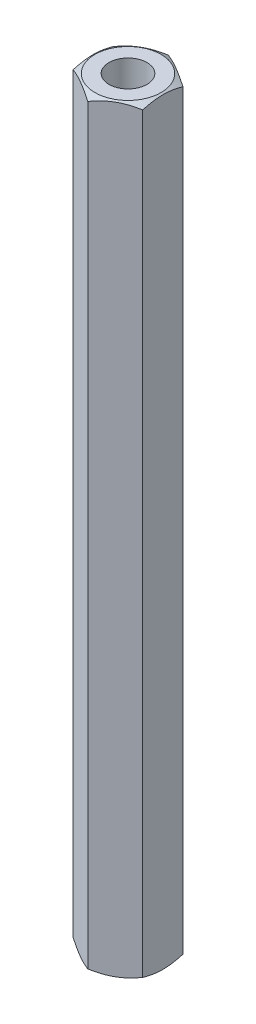
ISO-10303-21;
HEADER;
FILE_DESCRIPTION(('STEP AP214'),'2;1');
FILE_NAME('part.step','',(''),(''),'','','');
FILE_SCHEMA(('AUTOMOTIVE_DESIGN { 1 0 10303 214 1 1 1 1 }'));
ENDSEC;
DATA;
#1=APPLICATION_CONTEXT('core data for automotive mechanical design processes');
#2=APPLICATION_PROTOCOL_DEFINITION('international standard','automotive_design',2000,#1);
#3=PRODUCT_CONTEXT('',#1,'mechanical');
#4=PRODUCT('Part','Part','',(#3));
#5=PRODUCT_RELATED_PRODUCT_CATEGORY('part','',(#4));
#6=PRODUCT_DEFINITION_FORMATION('','',#4);
#7=PRODUCT_DEFINITION_CONTEXT('part definition',#1,'design');
#8=PRODUCT_DEFINITION('design','',#6,#7);
#9=PRODUCT_DEFINITION_SHAPE('','',#8);
#10=(LENGTH_UNIT() NAMED_UNIT(*) SI_UNIT(.MILLI.,.METRE.));
#11=(NAMED_UNIT(*) PLANE_ANGLE_UNIT() SI_UNIT($,.RADIAN.));
#12=(NAMED_UNIT(*) SI_UNIT($,.STERADIAN.) SOLID_ANGLE_UNIT());
#13=UNCERTAINTY_MEASURE_WITH_UNIT(LENGTH_MEASURE(1.E-05),#10,'distance_accuracy_value','');
#14=(GEOMETRIC_REPRESENTATION_CONTEXT(3) GLOBAL_UNCERTAINTY_ASSIGNED_CONTEXT((#13)) GLOBAL_UNIT_ASSIGNED_CONTEXT((#10,
#11,#12)) REPRESENTATION_CONTEXT('',''));
#15=CARTESIAN_POINT('',(0.,0.,0.));
#16=DIRECTION('',(0.,0.,1.));
#17=DIRECTION('',(1.,0.,0.));
#18=AXIS2_PLACEMENT_3D('',#15,#16,#17);
#19=CARTESIAN_POINT('',(0.,60.,0.));
#20=DIRECTION('',(0.,1.,0.));
#21=DIRECTION('',(0.,0.,1.));
#22=AXIS2_PLACEMENT_3D('',#19,#20,#21);
#23=PLANE('',#22);
#24=CARTESIAN_POINT('',(0.,60.,0.));
#25=DIRECTION('',(0.,1.,0.));
#26=DIRECTION('',(0.,0.,1.));
#27=AXIS2_PLACEMENT_3D('',#24,#25,#26);
#28=CIRCLE('',#27,1.5);
#29=CARTESIAN_POINT('',(0.,60.,1.5));
#30=VERTEX_POINT('',#29);
#31=EDGE_CURVE('E109',#30,#30,#28,.T.);
#32=ORIENTED_EDGE('',*,*,#31,.F.);
#33=EDGE_LOOP('',(#32));
#34=FACE_BOUND('',#33,.T.);
#35=CARTESIAN_POINT('',(0.,60.,0.));
#36=DIRECTION('',(0.,1.,0.));
#37=DIRECTION('',(0.,0.,1.));
#38=AXIS2_PLACEMENT_3D('',#35,#36,#37);
#39=CIRCLE('',#38,2.6125);
#40=CARTESIAN_POINT('',(0.,60.,2.6125));
#41=VERTEX_POINT('',#40);
#42=EDGE_CURVE('E214',#41,#41,#39,.T.);
#43=ORIENTED_EDGE('',*,*,#42,.T.);
#44=EDGE_LOOP('',(#43));
#45=FACE_BOUND('',#44,.T.);
#46=ADVANCED_FACE('F35',(#34,#45),#23,.T.);
#47=CARTESIAN_POINT('',(0.,0.,0.));
#48=DIRECTION('',(0.,1.,0.));
#49=DIRECTION('',(0.,0.,1.));
#50=AXIS2_PLACEMENT_3D('',#47,#48,#49);
#51=PLANE('',#50);
#52=CARTESIAN_POINT('',(0.,0.,0.));
#53=DIRECTION('',(0.,1.,0.));
#54=DIRECTION('',(0.,0.,1.));
#55=AXIS2_PLACEMENT_3D('',#52,#53,#54);
#56=CIRCLE('',#55,1.5);
#57=CARTESIAN_POINT('',(0.,0.,1.5));
#58=VERTEX_POINT('',#57);
#59=EDGE_CURVE('E114',#58,#58,#56,.T.);
#60=ORIENTED_EDGE('',*,*,#59,.T.);
#61=EDGE_LOOP('',(#60));
#62=FACE_BOUND('',#61,.T.);
#63=CARTESIAN_POINT('',(0.,0.,0.));
#64=DIRECTION('',(0.,1.,0.));
#65=DIRECTION('',(0.,0.,1.));
#66=AXIS2_PLACEMENT_3D('',#63,#64,#65);
#67=CIRCLE('',#66,2.6125);
#68=CARTESIAN_POINT('',(0.,0.,2.6125));
#69=VERTEX_POINT('',#68);
#70=EDGE_CURVE('E212',#69,#69,#67,.T.);
#71=ORIENTED_EDGE('',*,*,#70,.F.);
#72=EDGE_LOOP('',(#71));
#73=FACE_BOUND('',#72,.T.);
#74=ADVANCED_FACE('F138',(#62,#73),#51,.F.);
#75=CARTESIAN_POINT('',(0.,60.,0.));
#76=DIRECTION('',(0.,-1.,0.));
#77=DIRECTION('',(0.,0.,-1.));
#78=AXIS2_PLACEMENT_3D('',#75,#76,#77);
#79=CYLINDRICAL_SURFACE('',#78,1.5);
#80=ORIENTED_EDGE('',*,*,#31,.T.);
#81=EDGE_LOOP('',(#80));
#82=FACE_BOUND('',#81,.T.);
#83=ORIENTED_EDGE('',*,*,#59,.F.);
#84=EDGE_LOOP('',(#83));
#85=FACE_BOUND('',#84,.T.);
#86=ADVANCED_FACE('F222',(#82,#85),#79,.F.);
#87=CARTESIAN_POINT('',(0.,60.,0.));
#88=DIRECTION('',(0.,-1.,0.));
#89=DIRECTION('',(0.,0.,-1.));
#90=AXIS2_PLACEMENT_3D('',#87,#88,#89);
#91=CONICAL_SURFACE('',#90,2.6125,1.0471975511966);
#92=ORIENTED_EDGE('',*,*,#42,.F.);
#93=EDGE_LOOP('',(#92));
#94=FACE_BOUND('',#93,.T.);
#95=CARTESIAN_POINT('',(2.7502,59.6749275746217,-1.58759777021763));
#96=CARTESIAN_POINT('',(2.62935077934009,59.7152266757372,-1.65737010029699));
#97=CARTESIAN_POINT('',(2.50745839737737,59.7518774353888,-1.72774469983533));
#98=CARTESIAN_POINT('',(2.26156287327211,59.8158521550166,-1.86971254687003));
#99=CARTESIAN_POINT('',(2.13755536142614,59.8431534823119,-1.94130831721583));
#100=CARTESIAN_POINT('',(1.89107720202406,59.8856525926923,-2.08361254889599));
#101=CARTESIAN_POINT('',(1.76864448141258,59.901133219364,-2.15429911309864));
#102=CARTESIAN_POINT('',(1.52320285763108,59.9196149406165,-2.29600490065923));
#103=CARTESIAN_POINT('',(1.40019484676709,59.9226313385238,-2.36702360884404));
#104=CARTESIAN_POINT('',(1.1703412133892,59.9163611925579,-2.49972966594897));
#105=CARTESIAN_POINT('',(1.06346120874598,59.9086141837097,-2.56143686540073));
#106=CARTESIAN_POINT('',(0.850397532665248,59.8840591569221,-2.68444923614047));
#107=CARTESIAN_POINT('',(0.744214598351108,59.8672427483359,-2.74575398185008));
#108=CARTESIAN_POINT('',(0.530711510606813,59.8252024156405,-2.86902004703206));
#109=CARTESIAN_POINT('',(0.423418383857142,59.7998002572992,-2.93096576264318));
#110=CARTESIAN_POINT('',(0.210432520715947,59.7421471121464,-3.05393320806134));
#111=CARTESIAN_POINT('',(0.104737054973346,59.7099096746874,-3.11495651365995));
#112=CARTESIAN_POINT('',(-0.000200000000001703,59.6749275746217,-3.17554195059678));
#113=B_SPLINE_CURVE_WITH_KNOTS('',3,(#95,#96,#97,#98,#99,#100,#101,#102,#103,#104,#105,#106,
#107,#108,#109,#110,#111,#112),.UNSPECIFIED.,.F.,.F.,(4,2,2,2,2,2,2,2,4),(0.,0.435912828725889,
0.872873557116332,1.29901931904672,1.72464171213574,2.09526089052938,2.46622354066374,
2.84541551798557,3.22386274754524),.UNSPECIFIED.);
#114=CARTESIAN_POINT('',(2.75,59.6749942449246,-1.58771324027157));
#115=VERTEX_POINT('',#114);
#116=CARTESIAN_POINT('',(0.,59.6749942449246,-3.17542648054294));
#117=VERTEX_POINT('',#116);
#118=EDGE_CURVE('E92',#115,#117,#113,.T.);
#119=ORIENTED_EDGE('',*,*,#118,.T.);
#120=CARTESIAN_POINT('',(0.000199999999999699,59.6749275746217,-3.17554195059678));
#121=CARTESIAN_POINT('',(-0.120649220659906,59.7152266757372,-3.10576962051743));
#122=CARTESIAN_POINT('',(-0.242541602622633,59.7518774353888,-3.03539502097908));
#123=CARTESIAN_POINT('',(-0.488437126727892,59.8158521550166,-2.89342717394439));
#124=CARTESIAN_POINT('',(-0.612444638573855,59.8431534823119,-2.82183140359858));
#125=CARTESIAN_POINT('',(-0.858922797975943,59.8856525926923,-2.67952717191843));
#126=CARTESIAN_POINT('',(-0.981355518587417,59.901133219364,-2.60884060771577));
#127=CARTESIAN_POINT('',(-1.22679714236891,59.9196149406165,-2.46713482015519));
#128=CARTESIAN_POINT('',(-1.34980515323291,59.9226313385238,-2.39611611197038));
#129=CARTESIAN_POINT('',(-1.57965878661079,59.9163611925579,-2.26341005486544));
#130=CARTESIAN_POINT('',(-1.68653879125402,59.9086141837097,-2.20170285541369));
#131=CARTESIAN_POINT('',(-1.89960246733475,59.8840591569221,-2.07869048467395));
#132=CARTESIAN_POINT('',(-2.00578540164889,59.8672427483359,-2.01738573896433));
#133=CARTESIAN_POINT('',(-2.21928848939319,59.8252024156405,-1.89411967378235));
#134=CARTESIAN_POINT('',(-2.32658161614286,59.7998002572992,-1.83217395817123));
#135=CARTESIAN_POINT('',(-2.53956747928405,59.7421471121464,-1.70920651275308));
#136=CARTESIAN_POINT('',(-2.64526294502665,59.7099096746874,-1.64818320715446));
#137=CARTESIAN_POINT('',(-2.7502,59.6749275746217,-1.58759777021763));
#138=B_SPLINE_CURVE_WITH_KNOTS('',3,(#120,#121,#122,#123,#124,#125,#126,#127,#128,#129,#130,
#131,#132,#133,#134,#135,#136,#137),.UNSPECIFIED.,.F.,.F.,(4,2,2,2,2,2,2,2,4),(0.,
0.435912828725889,0.872873557116331,1.29901931904672,1.72464171213574,2.09526089052938,
2.46622354066374,2.84541551798558,3.22386274754524),.UNSPECIFIED.);
#139=CARTESIAN_POINT('',(-2.75,59.6749942449246,-1.58771324027157));
#140=VERTEX_POINT('',#139);
#141=EDGE_CURVE('E105',#117,#140,#138,.T.);
#142=ORIENTED_EDGE('',*,*,#141,.T.);
#143=CARTESIAN_POINT('',(-2.75,58.5406203615429,-4.34273627709843));
#144=CARTESIAN_POINT('',(-2.75,58.5995512449505,-4.22188934319985));
#145=CARTESIAN_POINT('',(-2.75,58.6579389545085,-4.10077310616707));
#146=CARTESIAN_POINT('',(-2.75,58.7733238087856,-3.85785897378004));
#147=CARTESIAN_POINT('',(-2.75,58.8303207481186,-3.73606098097169));
#148=CARTESIAN_POINT('',(-2.75,58.9428897586977,-3.49105015565451));
#149=CARTESIAN_POINT('',(-2.75,58.9984530419763,-3.36783327215281));
#150=CARTESIAN_POINT('',(-2.75,59.1074057175332,-3.12044567982309));
#151=CARTESIAN_POINT('',(-2.75,59.1607952079555,-2.9962750143587));
#152=CARTESIAN_POINT('',(-2.75,59.2665673020364,-2.74261247802163));
#153=CARTESIAN_POINT('',(-2.75,59.3188565803702,-2.61308148729981));
#154=CARTESIAN_POINT('',(-2.75,59.4196630131637,-2.35253344812464));
#155=CARTESIAN_POINT('',(-2.75,59.4681797555283,-2.22151623910964));
#156=CARTESIAN_POINT('',(-2.75,59.5602251596395,-1.95800765713079));
#157=CARTESIAN_POINT('',(-2.75,59.6037632457864,-1.825519608311));
#158=CARTESIAN_POINT('',(-2.75,59.6845065718331,-1.55864523862717));
#159=CARTESIAN_POINT('',(-2.75,59.7217137250606,-1.42425950462395));
#160=CARTESIAN_POINT('',(-2.75,59.7878762341809,-1.15421282140245));
#161=CARTESIAN_POINT('',(-2.75,59.8168754809288,-1.01856282197882));
#162=CARTESIAN_POINT('',(-2.75,59.8650176545002,-0.745498749386652));
#163=CARTESIAN_POINT('',(-2.75,59.8841617693091,-0.608084890889986));
#164=CARTESIAN_POINT('',(-2.75,59.9108210219719,-0.333999284368084));
#165=CARTESIAN_POINT('',(-2.75,59.9184913394408,-0.197343012825139));
#166=CARTESIAN_POINT('',(-2.75,59.92196638129,0.0761388381134712));
#167=CARTESIAN_POINT('',(-2.75,59.9177706676217,0.212964423573176));
#168=CARTESIAN_POINT('',(-2.75,59.9010524018598,0.442897381338829));
#169=CARTESIAN_POINT('',(-2.75,59.8915585585016,0.536240273380257));
#170=CARTESIAN_POINT('',(-2.75,59.8675974956824,0.722291094443569));
#171=CARTESIAN_POINT('',(-2.75,59.8531295936962,0.814998934544028));
#172=CARTESIAN_POINT('',(-2.75,59.8030140537033,1.0920464397374));
#173=CARTESIAN_POINT('',(-2.75,59.7606645358993,1.2751898611273));
#174=CARTESIAN_POINT('',(-2.75,59.6865847437191,1.54935337523094));
#175=CARTESIAN_POINT('',(-2.75,59.6597367728582,1.64177374964665));
#176=CARTESIAN_POINT('',(-2.75,59.6031151162674,1.82566290005102));
#177=CARTESIAN_POINT('',(-2.75,59.5733431426092,1.9171321986254));
#178=CARTESIAN_POINT('',(-2.75,59.5113437394389,2.0992247992071));
#179=CARTESIAN_POINT('',(-2.75,59.4791163653072,2.18984812024336));
#180=CARTESIAN_POINT('',(-2.75,59.4125996194613,2.37034590103641));
#181=CARTESIAN_POINT('',(-2.75,59.3783099731669,2.46022025925114));
#182=CARTESIAN_POINT('',(-2.75,59.2608962246007,2.75936539928423));
#183=CARTESIAN_POINT('',(-2.75,59.1739453993836,2.96713346142537));
#184=CARTESIAN_POINT('',(-2.75,58.9938060909695,3.37996038226034));
#185=CARTESIAN_POINT('',(-2.75,58.9006161622613,3.58501859985305));
#186=CARTESIAN_POINT('',(-2.75,58.7098724430771,3.9932338584204));
#187=CARTESIAN_POINT('',(-2.75,58.6123161252901,4.19638971383777));
#188=CARTESIAN_POINT('',(-2.75,58.4141357983774,4.60120111049432));
#189=CARTESIAN_POINT('',(-2.75,58.3135116809953,4.80285659847545));
#190=CARTESIAN_POINT('',(-2.75,58.1097763799173,5.20551334856282));
#191=CARTESIAN_POINT('',(-2.75,58.0066598016224,5.4065118747521));
#192=CARTESIAN_POINT('',(-2.75,57.7987300787626,5.80763279377473));
#193=CARTESIAN_POINT('',(-2.75,57.6939168998277,6.00775516875432));
#194=CARTESIAN_POINT('',(-2.75,57.3776363328163,6.60694679683371));
#195=CARTESIAN_POINT('',(-2.75,57.1642461942703,7.0050003091369));
#196=CARTESIAN_POINT('',(-2.75,56.7656901078734,7.74138460502686));
#197=CARTESIAN_POINT('',(-2.75,56.5809529129117,8.07994857167095));
#198=CARTESIAN_POINT('',(-2.75,56.2098143689312,8.75621335687721));
#199=CARTESIAN_POINT('',(-2.75,56.023412832211,9.09391407241522));
#200=CARTESIAN_POINT('',(-2.75,55.6502540640829,9.76716087185908));
#201=CARTESIAN_POINT('',(-2.75,55.4635020795946,10.1027098679721));
#202=CARTESIAN_POINT('',(-2.75,55.0891214306776,10.7732632757013));
#203=CARTESIAN_POINT('',(-2.75,54.9014928793886,11.1082677504652));
#204=CARTESIAN_POINT('',(-2.75,54.7135515816488,11.4430958456306));
#205=B_SPLINE_CURVE_WITH_KNOTS('',3,(#143,#144,#145,#146,#147,#148,#149,#150,#151,#152,#153,
#154,#155,#156,#157,#158,#159,#160,#161,#162,#163,#164,#165,#166,#167,#168,#169,#170,#171,#172,
#173,#174,#175,#176,#177,#178,#179,#180,#181,#182,#183,#184,#185,#186,#187,#188,#189,#190,#191,
#192,#193,#194,#195,#196,#197,#198,#199,#200,#201,#202,#203,#204),.UNSPECIFIED.,.F.,.F.,(4,2,2,
2,2,2,2,2,2,2,2,2,2,2,2,2,2,2,2,2,2,2,2,2,2,2,2,2,2,2,4),(0.,0.403354887049304,
0.806768984570567,1.21224826143521,1.61770921106387,2.03672462098682,2.45578573817066,
2.87403997678811,3.29216758566987,3.70801513582253,4.12381254595595,4.53393390741873,
4.94407040918969,5.2254090504022,5.50678631147495,6.06990109637446,6.35859737725744,
6.64712561623493,6.9356473495099,7.22420758325618,7.89971279308797,8.57537505310157,
9.2514335829726,9.9275159972652,10.6052227755989,11.2829433002046,12.637846064926,
13.794898825163,14.9520837666189,16.104134842161,17.2560411167923),.UNSPECIFIED.);
#206=CARTESIAN_POINT('',(-2.75,59.6749942449246,1.58771324027147));
#207=VERTEX_POINT('',#206);
#208=EDGE_CURVE('E203',#140,#207,#205,.T.);
#209=ORIENTED_EDGE('',*,*,#208,.T.);
#210=CARTESIAN_POINT('',(-2.7502,59.6749275746217,1.58759777021763));
#211=CARTESIAN_POINT('',(-2.6293507793401,59.7152266757372,1.65737010029699));
#212=CARTESIAN_POINT('',(-2.50745839737737,59.7518774353888,1.72774469983533));
#213=CARTESIAN_POINT('',(-2.26156287327211,59.8158521550166,1.86971254687003));
#214=CARTESIAN_POINT('',(-2.13755536142615,59.8431534823119,1.94130831721583));
#215=CARTESIAN_POINT('',(-1.89107720202406,59.8856525926923,2.08361254889599));
#216=CARTESIAN_POINT('',(-1.76864448141258,59.901133219364,2.15429911309864));
#217=CARTESIAN_POINT('',(-1.52320285763108,59.9196149406165,2.29600490065923));
#218=CARTESIAN_POINT('',(-1.40019484676709,59.9226313385238,2.36702360884404));
#219=CARTESIAN_POINT('',(-1.17034121338921,59.9163611925579,2.49972966594897));
#220=CARTESIAN_POINT('',(-1.06346120874598,59.9086141837097,2.56143686540073));
#221=CARTESIAN_POINT('',(-0.850397532665251,59.8840591569221,2.68444923614047));
#222=CARTESIAN_POINT('',(-0.744214598351112,59.8672427483359,2.74575398185008));
#223=CARTESIAN_POINT('',(-0.530711510606817,59.8252024156405,2.86902004703206));
#224=CARTESIAN_POINT('',(-0.423418383857145,59.7998002572992,2.93096576264318));
#225=CARTESIAN_POINT('',(-0.210432520715948,59.7421471121464,3.05393320806134));
#226=CARTESIAN_POINT('',(-0.104737054973347,59.7099096746874,3.11495651365995));
#227=CARTESIAN_POINT('',(0.000200000000001128,59.6749275746217,3.17554195059678));
#228=B_SPLINE_CURVE_WITH_KNOTS('',3,(#210,#211,#212,#213,#214,#215,#216,#217,#218,#219,#220,
#221,#222,#223,#224,#225,#226,#227),.UNSPECIFIED.,.F.,.F.,(4,2,2,2,2,2,2,2,4),(0.,
0.435912828725889,0.872873557116332,1.29901931904672,1.72464171213574,2.09526089052938,
2.46622354066374,2.84541551798557,3.22386274754525),.UNSPECIFIED.);
#229=CARTESIAN_POINT('',(0.,59.6749942449246,3.17542648054294));
#230=VERTEX_POINT('',#229);
#231=EDGE_CURVE('E207',#207,#230,#228,.T.);
#232=ORIENTED_EDGE('',*,*,#231,.T.);
#233=CARTESIAN_POINT('',(-0.000199999999998998,59.6749275746217,3.17554195059678));
#234=CARTESIAN_POINT('',(0.120649220659906,59.7152266757372,3.10576962051743));
#235=CARTESIAN_POINT('',(0.242541602622634,59.7518774353888,3.03539502097908));
#236=CARTESIAN_POINT('',(0.488437126727893,59.8158521550166,2.89342717394439));
#237=CARTESIAN_POINT('',(0.612444638573855,59.8431534823119,2.82183140359858));
#238=CARTESIAN_POINT('',(0.858922797975944,59.8856525926923,2.67952717191843));
#239=CARTESIAN_POINT('',(0.981355518587417,59.901133219364,2.60884060771577));
#240=CARTESIAN_POINT('',(1.22679714236892,59.9196149406165,2.46713482015519));
#241=CARTESIAN_POINT('',(1.34980515323291,59.9226313385238,2.39611611197038));
#242=CARTESIAN_POINT('',(1.57965878661079,59.9163611925579,2.26341005486544));
#243=CARTESIAN_POINT('',(1.68653879125402,59.9086141837097,2.20170285541369));
#244=CARTESIAN_POINT('',(1.89960246733475,59.8840591569221,2.07869048467395));
#245=CARTESIAN_POINT('',(2.00578540164889,59.8672427483359,2.01738573896433));
#246=CARTESIAN_POINT('',(2.21928848939318,59.8252024156405,1.89411967378235));
#247=CARTESIAN_POINT('',(2.32658161614285,59.7998002572992,1.83217395817123));
#248=CARTESIAN_POINT('',(2.53956747928405,59.7421471121464,1.70920651275308));
#249=CARTESIAN_POINT('',(2.64526294502665,59.7099096746874,1.64818320715446));
#250=CARTESIAN_POINT('',(2.7502,59.6749275746217,1.58759777021763));
#251=B_SPLINE_CURVE_WITH_KNOTS('',3,(#233,#234,#235,#236,#237,#238,#239,#240,#241,#242,#243,
#244,#245,#246,#247,#248,#249,#250),.UNSPECIFIED.,.F.,.F.,(4,2,2,2,2,2,2,2,4),(0.,
0.435912828725889,0.872873557116331,1.29901931904671,1.72464171213574,2.09526089052938,
2.46622354066374,2.84541551798557,3.22386274754524),.UNSPECIFIED.);
#252=CARTESIAN_POINT('',(2.75,59.6749942449246,1.58771324027147));
#253=VERTEX_POINT('',#252);
#254=EDGE_CURVE('E56',#230,#253,#251,.T.);
#255=ORIENTED_EDGE('',*,*,#254,.T.);
#256=CARTESIAN_POINT('',(2.75,58.5406203635158,-4.34273627305369));
#257=CARTESIAN_POINT('',(2.75,58.5995512468411,-4.22188933929182));
#258=CARTESIAN_POINT('',(2.75,58.6579389563167,-4.10077310239586));
#259=CARTESIAN_POINT('',(2.75,58.7733238104296,-3.85785897028287));
#260=CARTESIAN_POINT('',(2.75,58.8303207496807,-3.73606097761174));
#261=CARTESIAN_POINT('',(2.75,58.9428897600959,-3.49105015257107));
#262=CARTESIAN_POINT('',(2.75,58.9984530432926,-3.36783326920864));
#263=CARTESIAN_POINT('',(2.75,59.107405718687,-3.12044567715841));
#264=CARTESIAN_POINT('',(2.75,59.1607952090288,-2.99627501183424));
#265=CARTESIAN_POINT('',(2.75,59.2665673029465,-2.74261247578786));
#266=CARTESIAN_POINT('',(2.75,59.3188565811978,-2.61308148521662));
#267=CARTESIAN_POINT('',(2.75,59.4196630138306,-2.35253344634499));
#268=CARTESIAN_POINT('',(2.75,59.4681797561171,-2.22151623748295));
#269=CARTESIAN_POINT('',(2.75,59.5602251600793,-1.95800765581285));
#270=CARTESIAN_POINT('',(2.75,59.6037632461554,-1.82551960714884));
#271=CARTESIAN_POINT('',(2.75,59.6845065720718,-1.55864523778076));
#272=CARTESIAN_POINT('',(2.75,59.7217137252398,-1.42425950393753));
#273=CARTESIAN_POINT('',(2.75,59.7878762342398,-1.15421282111753));
#274=CARTESIAN_POINT('',(2.75,59.8168754809312,-1.01856282193652));
#275=CARTESIAN_POINT('',(2.75,59.8650176544262,-0.745498749835611));
#276=CARTESIAN_POINT('',(2.75,59.8841617692149,-0.608084891587556));
#277=CARTESIAN_POINT('',(2.75,59.910821021882,-0.333999285559012));
#278=CARTESIAN_POINT('',(2.75,59.9184913393744,-0.197343014260761));
#279=CARTESIAN_POINT('',(2.75,59.9219663813137,0.0761388361920072));
#280=CARTESIAN_POINT('',(2.75,59.917770667712,0.212964421410564));
#281=CARTESIAN_POINT('',(2.75,59.901052402085,0.442897378875901));
#282=CARTESIAN_POINT('',(2.75,59.8915585587799,0.536240270855414));
#283=CARTESIAN_POINT('',(2.75,59.86759749607,0.722291091797737));
#284=CARTESIAN_POINT('',(2.75,59.8531295941397,0.814998931839123));
#285=CARTESIAN_POINT('',(2.75,59.8030140543158,1.0920464368585));
#286=CARTESIAN_POINT('',(2.75,59.7606645366259,1.2751898581371));
#287=CARTESIAN_POINT('',(2.75,59.686584744614,1.54935337207348));
#288=CARTESIAN_POINT('',(2.75,59.6597367738099,1.6417737464317));
#289=CARTESIAN_POINT('',(2.75,59.6031151173307,1.82566289672184));
#290=CARTESIAN_POINT('',(2.75,59.5733431437274,1.91713219523946));
#291=CARTESIAN_POINT('',(2.75,59.5113437406649,2.0992247957081));
#292=CARTESIAN_POINT('',(2.75,59.4791163665862,2.18984811668803));
#293=CARTESIAN_POINT('',(2.75,59.4125996208442,2.37034589736841));
#294=CARTESIAN_POINT('',(2.75,59.3783099746008,2.4602202555268));
#295=CARTESIAN_POINT('',(2.75,59.2608962262642,2.75936539521362));
#296=CARTESIAN_POINT('',(2.75,59.1739454012286,2.96713345706725));
#297=CARTESIAN_POINT('',(2.75,58.9938060931778,3.37996037732898));
#298=CARTESIAN_POINT('',(2.75,58.9006161646512,3.58501859463597));
#299=CARTESIAN_POINT('',(2.75,58.7098724458294,3.99323385263252));
#300=CARTESIAN_POINT('',(2.75,58.6123161282229,4.1963897077648));
#301=CARTESIAN_POINT('',(2.75,58.4141358016699,4.60120110385106));
#302=CARTESIAN_POINT('',(2.75,58.3135116844669,4.80285659154699));
#303=CARTESIAN_POINT('',(2.75,58.1097763837456,5.2055133410641));
#304=CARTESIAN_POINT('',(2.75,58.0066598056283,5.4065118669683));
#305=CARTESIAN_POINT('',(2.75,57.7987300831222,5.80763278542033));
#306=CARTESIAN_POINT('',(2.75,57.6939169043636,6.00775516011442));
#307=CARTESIAN_POINT('',(2.75,57.3776363378793,6.6069467873365));
#308=CARTESIAN_POINT('',(2.75,57.1642461996826,7.00500029906727));
#309=CARTESIAN_POINT('',(2.75,56.7656901139068,7.74138459393802));
#310=CARTESIAN_POINT('',(2.75,56.5809529192171,8.07994856013535));
#311=CARTESIAN_POINT('',(2.75,56.2098143757784,8.75621334444711));
#312=CARTESIAN_POINT('',(2.75,56.0234128393281,9.09391405953738));
#313=CARTESIAN_POINT('',(2.75,55.6502540717394,9.76716085808257));
#314=CARTESIAN_POINT('',(2.75,55.4635020875207,10.1027098537447));
#315=CARTESIAN_POINT('',(2.75,55.0891214391416,10.7732632605714));
#316=CARTESIAN_POINT('',(2.75,54.9014928881212,11.1082677348838));
#317=CARTESIAN_POINT('',(2.75,54.7135515906493,11.4430958295974));
#318=B_SPLINE_CURVE_WITH_KNOTS('',3,(#256,#257,#258,#259,#260,#261,#262,#263,#264,#265,#266,
#267,#268,#269,#270,#271,#272,#273,#274,#275,#276,#277,#278,#279,#280,#281,#282,#283,#284,#285,
#286,#287,#288,#289,#290,#291,#292,#293,#294,#295,#296,#297,#298,#299,#300,#301,#302,#303,#304,
#305,#306,#307,#308,#309,#310,#311,#312,#313,#314,#315,#316,#317),.UNSPECIFIED.,.F.,.F.,(4,2,2,
2,2,2,2,2,2,2,2,2,2,2,2,2,2,2,2,2,2,2,2,2,2,2,2,2,2,2,4),(0.,0.403354886572336,
0.806768983616566,1.21224825999929,1.61770920914607,2.03672461855754,2.45578573522972,
2.87403997333713,3.29216758170924,3.70801513111625,4.12381254050513,4.53393390124178,
4.94407040228623,5.22540904329783,5.50678630416966,6.06990108866612,6.35859736933591,
6.64712560810046,6.93564734116296,7.22420757469668,7.89971278352244,8.57537504253004,
9.2514335713955,9.92751598468257,10.6052227620122,11.2829432856138,12.6378460483265,
13.7948988069961,14.9520837468849,16.1041348208517,17.2560410939075),.UNSPECIFIED.);
#319=EDGE_CURVE('E49',#253,#115,#318,.F.);
#320=ORIENTED_EDGE('',*,*,#319,.T.);
#321=EDGE_LOOP('',(#119,#142,#209,#232,#255,#320));
#322=FACE_BOUND('',#321,.T.);
#323=ADVANCED_FACE('F91',(#94,#322),#91,.T.);
#324=CARTESIAN_POINT('',(0.,0.,0.));
#325=DIRECTION('',(0.,1.,0.));
#326=DIRECTION('',(0.,0.,1.));
#327=AXIS2_PLACEMENT_3D('',#324,#325,#326);
#328=CONICAL_SURFACE('',#327,2.6125,1.0471975511966);
#329=ORIENTED_EDGE('',*,*,#70,.T.);
#330=EDGE_LOOP('',(#329));
#331=FACE_BOUND('',#330,.T.);
#332=CARTESIAN_POINT('',(2.75,1.42421736996008,-4.27047533887701));
#333=CARTESIAN_POINT('',(2.75,1.36588344164423,-4.15026846439408));
#334=CARTESIAN_POINT('',(2.75,1.30810739862857,-4.02978615221875));
#335=CARTESIAN_POINT('',(2.75,1.19398490856808,-3.7881241012886));
#336=CARTESIAN_POINT('',(2.75,1.13763868616414,-3.66694425656798));
#337=CARTESIAN_POINT('',(2.75,1.02640767672244,-3.42311954463453));
#338=CARTESIAN_POINT('',(2.75,0.971532457822887,-3.30047029742052));
#339=CARTESIAN_POINT('',(2.75,0.864021687687689,-3.05419769800804));
#340=CARTESIAN_POINT('',(2.75,0.811386030733114,-2.93057439211742));
#341=CARTESIAN_POINT('',(2.75,0.7073330293466,-2.67824595120125));
#342=CARTESIAN_POINT('',(2.75,0.656006136511101,-2.54950331257935));
#343=CARTESIAN_POINT('',(2.75,0.557223253796197,-2.29051423279059));
#344=CARTESIAN_POINT('',(2.75,0.509767697037841,-2.16026762521701));
#345=CARTESIAN_POINT('',(2.75,0.419968349171761,-1.89830486027644));
#346=CARTESIAN_POINT('',(2.75,0.377614286221965,-1.76659225965154));
#347=CARTESIAN_POINT('',(2.75,0.2993727586576,-1.50127832255457));
#348=CARTESIAN_POINT('',(2.75,0.263483265691549,-1.36767759274892));
#349=CARTESIAN_POINT('',(2.75,0.200067476924553,-1.09920301004129));
#350=CARTESIAN_POINT('',(2.75,0.172498679358677,-0.964339384475804));
#351=CARTESIAN_POINT('',(2.75,0.127297190913735,-0.692930133062956));
#352=CARTESIAN_POINT('',(2.75,0.109663459432473,-0.556384684901718));
#353=CARTESIAN_POINT('',(2.75,0.0859689529942003,-0.284078295863271));
#354=CARTESIAN_POINT('',(2.75,0.0797589869982874,-0.148330664629213));
#355=CARTESIAN_POINT('',(2.75,0.0790454593978172,0.123209593808049));
#356=CARTESIAN_POINT('',(2.75,0.0845423598303597,0.259002222575694));
#357=CARTESIAN_POINT('',(2.75,0.103402435414983,0.489288862778929));
#358=CARTESIAN_POINT('',(2.75,0.113932798074015,0.584029098329771));
#359=CARTESIAN_POINT('',(2.75,0.140040395862,0.77281629409548));
#360=CARTESIAN_POINT('',(2.75,0.155618306291414,0.866863159823046));
#361=CARTESIAN_POINT('',(2.75,0.209104281903755,1.14783082997688));
#362=CARTESIAN_POINT('',(2.75,0.253755644909843,1.33348225969138));
#363=CARTESIAN_POINT('',(2.75,0.331222471899179,1.61124830917725));
#364=CARTESIAN_POINT('',(2.75,0.359181124483459,1.70479911757213));
#365=CARTESIAN_POINT('',(2.75,0.418005544358805,1.89099111375209));
#366=CARTESIAN_POINT('',(2.75,0.448871335014733,1.98363229421983));
#367=CARTESIAN_POINT('',(2.75,0.513014252955235,2.16803717303894));
#368=CARTESIAN_POINT('',(2.75,0.546290652464237,2.25980112683726));
#369=CARTESIAN_POINT('',(2.75,0.614862854071362,2.44256590231729));
#370=CARTESIAN_POINT('',(2.75,0.650158598140141,2.53356674584221));
#371=CARTESIAN_POINT('',(2.75,0.755167686610225,2.79703790411368));
#372=CARTESIAN_POINT('',(2.75,0.827092567768282,2.96862620378303));
#373=CARTESIAN_POINT('',(2.75,0.975313093381369,3.30991196090052));
#374=CARTESIAN_POINT('',(2.75,1.05160933934538,3.47960915427238));
#375=CARTESIAN_POINT('',(2.75,1.20743867068589,3.81759111023468));
#376=CARTESIAN_POINT('',(2.75,1.28697308753292,3.98587525679301));
#377=CARTESIAN_POINT('',(2.75,1.44844363012268,4.32128987558611));
#378=CARTESIAN_POINT('',(2.75,1.53037983574984,4.48842030921901));
#379=CARTESIAN_POINT('',(2.75,1.69622918133558,4.82205994904994));
#380=CARTESIAN_POINT('',(2.75,1.78014552728436,4.98856755820017));
#381=CARTESIAN_POINT('',(2.75,1.94941198319472,5.32085318423486));
#382=CARTESIAN_POINT('',(2.75,2.03476210793088,5.48663119357881));
#383=CARTESIAN_POINT('',(2.75,2.2924491427626,5.98300308695626));
#384=CARTESIAN_POINT('',(2.75,2.4664673022875,6.31272364934061));
#385=CARTESIAN_POINT('',(2.75,2.79671035440082,6.93179047675389));
#386=CARTESIAN_POINT('',(2.75,2.95261192302328,7.22131003963411));
#387=CARTESIAN_POINT('',(2.75,3.26606681667408,7.79948143505547));
#388=CARTESIAN_POINT('',(2.75,3.42362026493178,8.08813320076263));
#389=CARTESIAN_POINT('',(2.75,3.73937181781602,8.66375187877466));
#390=CARTESIAN_POINT('',(2.75,3.89756565425656,8.9507211357946));
#391=CARTESIAN_POINT('',(2.75,4.21486696383449,9.52412078831611));
#392=CARTESIAN_POINT('',(2.75,4.3739743540514,9.81055122968642));
#393=CARTESIAN_POINT('',(2.75,4.53341099213488,10.096797257493));
#394=B_SPLINE_CURVE_WITH_KNOTS('',3,(#332,#333,#334,#335,#336,#337,#338,#339,#340,#341,#342,
#343,#344,#345,#346,#347,#348,#349,#350,#351,#352,#353,#354,#355,#356,#357,#358,#359,#360,#361,
#362,#363,#364,#365,#366,#367,#368,#369,#370,#371,#372,#373,#374,#375,#376,#377,#378,#379,#380,
#381,#382,#383,#384,#385,#386,#387,#388,#389,#390,#391,#392,#393),.UNSPECIFIED.,.F.,.F.,(4,2,2,
2,2,2,2,2,2,2,2,2,2,2,2,2,2,2,2,2,2,2,2,2,2,2,2,2,2,2,4),(0.,0.400845070608445,
0.801752733378066,1.20483175024068,1.60789171852649,2.02363447218541,2.43942367510296,
2.85436117354822,3.2691682517545,3.68181918500876,4.09442688902526,4.50160672443171,
4.90880263037913,5.19463530411768,5.48050623458988,6.05253736376292,6.3454303502188,
6.63832569087608,6.93113297047087,7.22393183996642,7.78199450799658,8.34013415191295,
8.8985056563406,9.45689575354166,10.0162621364264,10.5756342869188,11.6940804841763,
12.6805548062881,13.6671032500271,14.6501527552098,15.6331143997538),.UNSPECIFIED.);
#395=CARTESIAN_POINT('',(2.75,0.325005755075431,1.58771324027147));
#396=VERTEX_POINT('',#395);
#397=CARTESIAN_POINT('',(2.75,0.325005755075431,-1.58771324027147));
#398=VERTEX_POINT('',#397);
#399=EDGE_CURVE('E11',#396,#398,#394,.F.);
#400=ORIENTED_EDGE('',*,*,#399,.F.);
#401=CARTESIAN_POINT('',(-0.000199999999999037,0.32507242537833,3.17554195059678));
#402=CARTESIAN_POINT('',(0.120649220659907,0.284773324262833,3.10576962051743));
#403=CARTESIAN_POINT('',(0.242541602622635,0.248122564611233,3.03539502097908));
#404=CARTESIAN_POINT('',(0.488437126727893,0.184147844983372,2.89342717394439));
#405=CARTESIAN_POINT('',(0.612444638573856,0.156846517688069,2.82183140359858));
#406=CARTESIAN_POINT('',(0.858922797975944,0.114347407307689,2.67952717191843));
#407=CARTESIAN_POINT('',(0.981355518587418,0.0988667806360303,2.60884060771577));
#408=CARTESIAN_POINT('',(1.22679714236892,0.0803850593835132,2.46713482015519));
#409=CARTESIAN_POINT('',(1.34980515323291,0.0773686614761723,2.39611611197038));
#410=CARTESIAN_POINT('',(1.57965878661079,0.0836388074421192,2.26341005486544));
#411=CARTESIAN_POINT('',(1.68653879125402,0.0913858162902749,2.20170285541369));
#412=CARTESIAN_POINT('',(1.89960246733475,0.115940843077927,2.07869048467395));
#413=CARTESIAN_POINT('',(2.00578540164889,0.132757251664142,2.01738573896434));
#414=CARTESIAN_POINT('',(2.21928848939318,0.174797584359527,1.89411967378235));
#415=CARTESIAN_POINT('',(2.32658161614285,0.200199742700801,1.83217395817123));
#416=CARTESIAN_POINT('',(2.53956747928405,0.257852887853552,1.70920651275308));
#417=CARTESIAN_POINT('',(2.64526294502665,0.290090325312552,1.64818320715446));
#418=CARTESIAN_POINT('',(2.7502,0.325072425378329,1.58759777021763));
#419=B_SPLINE_CURVE_WITH_KNOTS('',3,(#401,#402,#403,#404,#405,#406,#407,#408,#409,#410,#411,
#412,#413,#414,#415,#416,#417,#418),.UNSPECIFIED.,.F.,.F.,(4,2,2,2,2,2,2,2,4),(0.,
0.435912828725888,0.872873557116331,1.29901931904671,1.72464171213573,2.09526089052937,
2.46622354066374,2.84541551798557,3.22386274754524),.UNSPECIFIED.);
#420=CARTESIAN_POINT('',(0.,0.325005755075432,3.17542648054294));
#421=VERTEX_POINT('',#420);
#422=EDGE_CURVE('E104',#421,#396,#419,.T.);
#423=ORIENTED_EDGE('',*,*,#422,.F.);
#424=CARTESIAN_POINT('',(-2.7502,0.32507242537833,1.58759777021763));
#425=CARTESIAN_POINT('',(-2.6293507793401,0.284773324262834,1.65737010029699));
#426=CARTESIAN_POINT('',(-2.50745839737737,0.248122564611233,1.72774469983533));
#427=CARTESIAN_POINT('',(-2.26156287327211,0.184147844983372,1.86971254687003));
#428=CARTESIAN_POINT('',(-2.13755536142615,0.156846517688069,1.94130831721583));
#429=CARTESIAN_POINT('',(-1.89107720202406,0.114347407307689,2.08361254889599));
#430=CARTESIAN_POINT('',(-1.76864448141258,0.0988667806360301,2.15429911309864));
#431=CARTESIAN_POINT('',(-1.52320285763109,0.0803850593835128,2.29600490065923));
#432=CARTESIAN_POINT('',(-1.40019484676709,0.0773686614761719,2.36702360884404));
#433=CARTESIAN_POINT('',(-1.17034121338921,0.0836388074421186,2.49972966594897));
#434=CARTESIAN_POINT('',(-1.06346120874598,0.0913858162902742,2.56143686540073));
#435=CARTESIAN_POINT('',(-0.850397532665251,0.115940843077926,2.68444923614047));
#436=CARTESIAN_POINT('',(-0.744214598351111,0.132757251664142,2.74575398185008));
#437=CARTESIAN_POINT('',(-0.530711510606816,0.174797584359527,2.86902004703206));
#438=CARTESIAN_POINT('',(-0.423418383857144,0.200199742700801,2.93096576264318));
#439=CARTESIAN_POINT('',(-0.210432520715948,0.257852887853552,3.05393320806134));
#440=CARTESIAN_POINT('',(-0.104737054973346,0.290090325312552,3.11495651365995));
#441=CARTESIAN_POINT('',(0.000200000000001466,0.32507242537833,3.17554195059678));
#442=B_SPLINE_CURVE_WITH_KNOTS('',3,(#424,#425,#426,#427,#428,#429,#430,#431,#432,#433,#434,
#435,#436,#437,#438,#439,#440,#441),.UNSPECIFIED.,.F.,.F.,(4,2,2,2,2,2,2,2,4),(0.,
0.435912828725888,0.872873557116332,1.29901931904671,1.72464171213573,2.09526089052937,
2.46622354066374,2.84541551798557,3.22386274754524),.UNSPECIFIED.);
#443=CARTESIAN_POINT('',(-2.75,0.325005755075432,1.58771324027147));
#444=VERTEX_POINT('',#443);
#445=EDGE_CURVE('E161',#444,#421,#442,.T.);
#446=ORIENTED_EDGE('',*,*,#445,.F.);
#447=CARTESIAN_POINT('',(-2.75,1.42421737002393,-4.27047533900854));
#448=CARTESIAN_POINT('',(-2.75,1.3658834417054,-4.15026846452119));
#449=CARTESIAN_POINT('',(-2.75,1.30810739868707,-4.02978615234143));
#450=CARTESIAN_POINT('',(-2.75,1.19398490862125,-3.7881241014024));
#451=CARTESIAN_POINT('',(-2.75,1.13763868621465,-3.66694425667734));
#452=CARTESIAN_POINT('',(-2.75,1.02640767676763,-3.42311954473492));
#453=CARTESIAN_POINT('',(-2.75,0.971532457865408,-3.3004702975164));
#454=CARTESIAN_POINT('',(-2.75,0.86402168772493,-3.05419769809487));
#455=CARTESIAN_POINT('',(-2.75,0.811386030767738,-2.9305743921997));
#456=CARTESIAN_POINT('',(-2.75,0.70733302937593,-2.67824595127412));
#457=CARTESIAN_POINT('',(-2.75,0.656006136537761,-2.54950331264734));
#458=CARTESIAN_POINT('',(-2.75,0.557223253817659,-2.29051423284876));
#459=CARTESIAN_POINT('',(-2.75,0.509767697056777,-2.16026762527023));
#460=CARTESIAN_POINT('',(-2.75,0.419968349185891,-1.89830486031967));
#461=CARTESIAN_POINT('',(-2.75,0.377614286233814,-1.76659225968973));
#462=CARTESIAN_POINT('',(-2.75,0.299372758665263,-1.50127832258253));
#463=CARTESIAN_POINT('',(-2.75,0.263483265697308,-1.36767759277171));
#464=CARTESIAN_POINT('',(-2.75,0.200067476926476,-1.09920301005101));
#465=CARTESIAN_POINT('',(-2.75,0.17249867935882,-0.964339384477597));
#466=CARTESIAN_POINT('',(-2.75,0.127297190911521,-0.692930133048713));
#467=CARTESIAN_POINT('',(-2.75,0.10966345942968,-0.556384684879364));
#468=CARTESIAN_POINT('',(-2.75,0.0859689529916933,-0.284078295824829));
#469=CARTESIAN_POINT('',(-2.75,0.079758986996618,-0.148330664582796));
#470=CARTESIAN_POINT('',(-2.75,0.0790454593992029,0.12320959387029));
#471=CARTESIAN_POINT('',(-2.75,0.0845423598339633,0.259002222645784));
#472=CARTESIAN_POINT('',(-2.75,0.103402435423045,0.489288862858943));
#473=CARTESIAN_POINT('',(-2.75,0.113932798083851,0.584029098411948));
#474=CARTESIAN_POINT('',(-2.75,0.14004039587548,0.772816294181888));
#475=CARTESIAN_POINT('',(-2.75,0.155618306306764,0.866863159911522));
#476=CARTESIAN_POINT('',(-2.75,0.209104281924753,1.14783083007145));
#477=CARTESIAN_POINT('',(-2.75,0.253755644934659,1.33348225978986));
#478=CARTESIAN_POINT('',(-2.75,0.331222471929637,1.61124830928159));
#479=CARTESIAN_POINT('',(-2.75,0.359181124515812,1.70479911767845));
#480=CARTESIAN_POINT('',(-2.75,0.418005544394892,1.89099111386238));
#481=CARTESIAN_POINT('',(-2.75,0.44887133505266,1.98363229433209));
#482=CARTESIAN_POINT('',(-2.75,0.513014252996777,2.16803717315513));
#483=CARTESIAN_POINT('',(-2.75,0.546290652507556,2.25980112695542));
#484=CARTESIAN_POINT('',(-2.75,0.614862854118174,2.44256590243936));
#485=CARTESIAN_POINT('',(-2.75,0.650158598188669,2.53356674596623));
#486=CARTESIAN_POINT('',(-2.75,0.755167686661786,2.7970379042387));
#487=CARTESIAN_POINT('',(-2.75,0.827092567820923,2.96862620390715));
#488=CARTESIAN_POINT('',(-2.75,0.975313093435809,3.30991196102297));
#489=CARTESIAN_POINT('',(-2.75,1.05160933940054,3.47960915439405));
#490=CARTESIAN_POINT('',(-2.75,1.20743867074225,3.81759111035488));
#491=CARTESIAN_POINT('',(-2.75,1.28697308758975,3.98587525691252));
#492=CARTESIAN_POINT('',(-2.75,1.44844363018028,4.32128987570431));
#493=CARTESIAN_POINT('',(-2.75,1.53037983580775,4.48842030933659));
#494=CARTESIAN_POINT('',(-2.75,1.69622918139395,4.82205994916629));
#495=CARTESIAN_POINT('',(-2.75,1.7801455273429,4.98856755831591));
#496=CARTESIAN_POINT('',(-2.75,1.9494119832535,5.32085318434942));
#497=CARTESIAN_POINT('',(-2.75,2.03476210798974,5.48663119369281));
#498=CARTESIAN_POINT('',(-2.75,2.2924491428216,5.98300308706862));
#499=CARTESIAN_POINT('',(-2.75,2.46646730234646,6.31272364945194));
#500=CARTESIAN_POINT('',(-2.75,2.79671035446012,6.93179047686436));
#501=CARTESIAN_POINT('',(-2.75,2.95261192308297,7.22131003974472));
#502=CARTESIAN_POINT('',(-2.75,3.26606681673449,7.7994814351664));
#503=CARTESIAN_POINT('',(-2.75,3.42362026499252,8.08813320087373));
#504=CARTESIAN_POINT('',(-2.75,3.73937181787744,8.66375187888626));
#505=CARTESIAN_POINT('',(-2.75,3.89756565431835,8.95072113590654));
#506=CARTESIAN_POINT('',(-2.75,4.21486696389697,9.52412078842873));
#507=CARTESIAN_POINT('',(-2.75,4.37397435411421,9.8105512297994));
#508=CARTESIAN_POINT('',(-2.75,4.53341099219802,10.0967972576063));
#509=B_SPLINE_CURVE_WITH_KNOTS('',3,(#447,#448,#449,#450,#451,#452,#453,#454,#455,#456,#457,
#458,#459,#460,#461,#462,#463,#464,#465,#466,#467,#468,#469,#470,#471,#472,#473,#474,#475,#476,
#477,#478,#479,#480,#481,#482,#483,#484,#485,#486,#487,#488,#489,#490,#491,#492,#493,#494,#495,
#496,#497,#498,#499,#500,#501,#502,#503,#504,#505,#506,#507,#508),.UNSPECIFIED.,.F.,.F.,(4,2,2,
2,2,2,2,2,2,2,2,2,2,2,2,2,2,2,2,2,2,2,2,2,2,2,2,2,2,2,4),(0.,0.400845070623898,
0.801752733408976,1.20483175028722,1.60789171858865,2.02363447226411,2.4394236751982,
2.85436117365995,3.2691682518827,3.68181918516126,4.09442688920204,4.50160672463219,
4.90880263060332,5.1946353043489,5.48050623482814,6.05253736401528,6.34543035047852,
6.63832569114316,6.93113297074529,7.22393184024818,7.78199450827713,8.34013415219227,
8.89850565661865,9.45689575381844,10.0162621367017,10.5756342871927,11.6940804844475,
12.6805548065603,13.6671032503002,14.6501527554842,15.6331144000296),.UNSPECIFIED.);
#510=CARTESIAN_POINT('',(-2.75,0.32500575507517,-1.58771324027186));
#511=VERTEX_POINT('',#510);
#512=EDGE_CURVE('E179',#511,#444,#509,.T.);
#513=ORIENTED_EDGE('',*,*,#512,.F.);
#514=CARTESIAN_POINT('',(0.000199999999999035,0.325072425378329,-3.17554195059678));
#515=CARTESIAN_POINT('',(-0.120649220659907,0.284773324262833,-3.10576962051743));
#516=CARTESIAN_POINT('',(-0.242541602622635,0.248122564611232,-3.03539502097908));
#517=CARTESIAN_POINT('',(-0.488437126727893,0.184147844983372,-2.89342717394439));
#518=CARTESIAN_POINT('',(-0.612444638573856,0.156846517688069,-2.82183140359858));
#519=CARTESIAN_POINT('',(-0.858922797975944,0.114347407307689,-2.67952717191842));
#520=CARTESIAN_POINT('',(-0.981355518587417,0.0988667806360299,-2.60884060771577));
#521=CARTESIAN_POINT('',(-1.22679714236892,0.0803850593835128,-2.46713482015519));
#522=CARTESIAN_POINT('',(-1.34980515323291,0.077368661476172,-2.39611611197038));
#523=CARTESIAN_POINT('',(-1.57965878661079,0.0836388074421189,-2.26341005486544));
#524=CARTESIAN_POINT('',(-1.68653879125402,0.0913858162902746,-2.20170285541369));
#525=CARTESIAN_POINT('',(-1.89960246733475,0.115940843077927,-2.07869048467395));
#526=CARTESIAN_POINT('',(-2.00578540164889,0.132757251664142,-2.01738573896433));
#527=CARTESIAN_POINT('',(-2.21928848939318,0.174797584359528,-1.89411967378235));
#528=CARTESIAN_POINT('',(-2.32658161614286,0.200199742700802,-1.83217395817123));
#529=CARTESIAN_POINT('',(-2.53956747928405,0.257852887853553,-1.70920651275308));
#530=CARTESIAN_POINT('',(-2.64526294502665,0.290090325312553,-1.64818320715446));
#531=CARTESIAN_POINT('',(-2.7502,0.32507242537833,-1.58759777021763));
#532=B_SPLINE_CURVE_WITH_KNOTS('',3,(#514,#515,#516,#517,#518,#519,#520,#521,#522,#523,#524,
#525,#526,#527,#528,#529,#530,#531),.UNSPECIFIED.,.F.,.F.,(4,2,2,2,2,2,2,2,4),(0.,
0.435912828725888,0.872873557116331,1.29901931904671,1.72464171213573,2.09526089052937,
2.46622354066374,2.84541551798557,3.22386274754524),.UNSPECIFIED.);
#533=CARTESIAN_POINT('',(0.,0.325005755075431,-3.17542648054294));
#534=VERTEX_POINT('',#533);
#535=EDGE_CURVE('E184',#534,#511,#532,.T.);
#536=ORIENTED_EDGE('',*,*,#535,.F.);
#537=CARTESIAN_POINT('',(2.7502,0.325072425378329,-1.58759777021763));
#538=CARTESIAN_POINT('',(2.62935077934009,0.284773324262832,-1.65737010029699));
#539=CARTESIAN_POINT('',(2.50745839737736,0.248122564611232,-1.72774469983533));
#540=CARTESIAN_POINT('',(2.26156287327211,0.184147844983372,-1.86971254687003));
#541=CARTESIAN_POINT('',(2.13755536142614,0.156846517688069,-1.94130831721583));
#542=CARTESIAN_POINT('',(1.89107720202405,0.114347407307689,-2.08361254889599));
#543=CARTESIAN_POINT('',(1.76864448141258,0.0988667806360296,-2.15429911309864));
#544=CARTESIAN_POINT('',(1.52320285763108,0.0803850593835124,-2.29600490065923));
#545=CARTESIAN_POINT('',(1.40019484676709,0.0773686614761718,-2.36702360884404));
#546=CARTESIAN_POINT('',(1.17034121338921,0.0836388074421188,-2.49972966594897));
#547=CARTESIAN_POINT('',(1.06346120874598,0.0913858162902744,-2.56143686540073));
#548=CARTESIAN_POINT('',(0.85039753266525,0.115940843077927,-2.68444923614047));
#549=CARTESIAN_POINT('',(0.74421459835111,0.132757251664142,-2.74575398185008));
#550=CARTESIAN_POINT('',(0.530711510606816,0.174797584359527,-2.86902004703206));
#551=CARTESIAN_POINT('',(0.423418383857145,0.200199742700801,-2.93096576264318));
#552=CARTESIAN_POINT('',(0.210432520715948,0.257852887853552,-3.05393320806134));
#553=CARTESIAN_POINT('',(0.104737054973346,0.290090325312552,-3.11495651365995));
#554=CARTESIAN_POINT('',(-0.000200000000001092,0.32507242537833,-3.17554195059678));
#555=B_SPLINE_CURVE_WITH_KNOTS('',3,(#537,#538,#539,#540,#541,#542,#543,#544,#545,#546,#547,
#548,#549,#550,#551,#552,#553,#554),.UNSPECIFIED.,.F.,.F.,(4,2,2,2,2,2,2,2,4),(0.,
0.435912828725887,0.872873557116331,1.29901931904671,1.72464171213573,2.09526089052937,
2.46622354066374,2.84541551798557,3.22386274754524),.UNSPECIFIED.);
#556=EDGE_CURVE('E64',#398,#534,#555,.T.);
#557=ORIENTED_EDGE('',*,*,#556,.F.);
#558=EDGE_LOOP('',(#400,#423,#446,#513,#536,#557));
#559=FACE_BOUND('',#558,.T.);
#560=ADVANCED_FACE('F137',(#331,#559),#328,.T.);
#561=CARTESIAN_POINT('',(2.75,60.,1.58771324027147));
#562=DIRECTION('',(-1.,0.,0.));
#563=DIRECTION('',(0.,0.,1.));
#564=AXIS2_PLACEMENT_3D('',#561,#562,#563);
#565=PLANE('',#564);
#566=DIRECTION('',(0.,-1.,0.));
#567=VECTOR('',#566,1.);
#568=CARTESIAN_POINT('',(2.75,60.,1.58771324027147));
#569=LINE('',#568,#567);
#570=EDGE_CURVE('E108',#253,#396,#569,.T.);
#571=ORIENTED_EDGE('',*,*,#570,.T.);
#572=ORIENTED_EDGE('',*,*,#399,.T.);
#573=DIRECTION('',(0.,-1.,0.));
#574=VECTOR('',#573,1.);
#575=CARTESIAN_POINT('',(2.75,60.,-1.58771324027147));
#576=LINE('',#575,#574);
#577=EDGE_CURVE('E102',#115,#398,#576,.T.);
#578=ORIENTED_EDGE('',*,*,#577,.F.);
#579=ORIENTED_EDGE('',*,*,#319,.F.);
#580=EDGE_LOOP('',(#571,#572,#578,#579));
#581=FACE_BOUND('',#580,.T.);
#582=ADVANCED_FACE('F107',(#581),#565,.F.);
#583=CARTESIAN_POINT('',(0.,60.,3.17542648054294));
#584=DIRECTION('',(-0.5,0.,-0.866025403784439));
#585=DIRECTION('',(-0.866025403784439,0.,0.5));
#586=AXIS2_PLACEMENT_3D('',#583,#584,#585);
#587=PLANE('',#586);
#588=DIRECTION('',(0.,-1.,0.));
#589=VECTOR('',#588,1.);
#590=CARTESIAN_POINT('',(0.,60.,3.17542648054294));
#591=LINE('',#590,#589);
#592=EDGE_CURVE('E111',#230,#421,#591,.T.);
#593=ORIENTED_EDGE('',*,*,#592,.T.);
#594=ORIENTED_EDGE('',*,*,#422,.T.);
#595=ORIENTED_EDGE('',*,*,#570,.F.);
#596=ORIENTED_EDGE('',*,*,#254,.F.);
#597=EDGE_LOOP('',(#593,#594,#595,#596));
#598=FACE_BOUND('',#597,.T.);
#599=ADVANCED_FACE('F136',(#598),#587,.F.);
#600=CARTESIAN_POINT('',(-2.75,60.,1.58771324027147));
#601=DIRECTION('',(0.5,0.,-0.866025403784439));
#602=DIRECTION('',(-0.866025403784439,0.,-0.5));
#603=AXIS2_PLACEMENT_3D('',#600,#601,#602);
#604=PLANE('',#603);
#605=DIRECTION('',(0.,-1.,0.));
#606=VECTOR('',#605,1.);
#607=CARTESIAN_POINT('',(-2.75,60.,1.58771324027147));
#608=LINE('',#607,#606);
#609=EDGE_CURVE('E120',#207,#444,#608,.T.);
#610=ORIENTED_EDGE('',*,*,#609,.T.);
#611=ORIENTED_EDGE('',*,*,#445,.T.);
#612=ORIENTED_EDGE('',*,*,#592,.F.);
#613=ORIENTED_EDGE('',*,*,#231,.F.);
#614=EDGE_LOOP('',(#610,#611,#612,#613));
#615=FACE_BOUND('',#614,.T.);
#616=ADVANCED_FACE('F144',(#615),#604,.F.);
#617=CARTESIAN_POINT('',(-2.75,60.,-1.58771324027147));
#618=DIRECTION('',(1.,0.,0.));
#619=DIRECTION('',(0.,0.,-1.));
#620=AXIS2_PLACEMENT_3D('',#617,#618,#619);
#621=PLANE('',#620);
#622=DIRECTION('',(0.,-1.,0.));
#623=VECTOR('',#622,1.);
#624=CARTESIAN_POINT('',(-2.75,60.,-1.58771324027147));
#625=LINE('',#624,#623);
#626=EDGE_CURVE('E123',#140,#511,#625,.T.);
#627=ORIENTED_EDGE('',*,*,#626,.T.);
#628=ORIENTED_EDGE('',*,*,#512,.T.);
#629=ORIENTED_EDGE('',*,*,#609,.F.);
#630=ORIENTED_EDGE('',*,*,#208,.F.);
#631=EDGE_LOOP('',(#627,#628,#629,#630));
#632=FACE_BOUND('',#631,.T.);
#633=ADVANCED_FACE('F195',(#632),#621,.F.);
#634=CARTESIAN_POINT('',(0.,60.,-3.17542648054294));
#635=DIRECTION('',(0.5,0.,0.866025403784439));
#636=DIRECTION('',(0.866025403784439,0.,-0.5));
#637=AXIS2_PLACEMENT_3D('',#634,#635,#636);
#638=PLANE('',#637);
#639=DIRECTION('',(0.,-1.,0.));
#640=VECTOR('',#639,1.);
#641=CARTESIAN_POINT('',(0.,60.,-3.17542648054294));
#642=LINE('',#641,#640);
#643=EDGE_CURVE('E98',#117,#534,#642,.T.);
#644=ORIENTED_EDGE('',*,*,#643,.T.);
#645=ORIENTED_EDGE('',*,*,#535,.T.);
#646=ORIENTED_EDGE('',*,*,#626,.F.);
#647=ORIENTED_EDGE('',*,*,#141,.F.);
#648=EDGE_LOOP('',(#644,#645,#646,#647));
#649=FACE_BOUND('',#648,.T.);
#650=ADVANCED_FACE('F192',(#649),#638,.F.);
#651=CARTESIAN_POINT('',(2.75,60.,-1.58771324027147));
#652=DIRECTION('',(-0.5,0.,0.866025403784439));
#653=DIRECTION('',(0.866025403784439,0.,0.5));
#654=AXIS2_PLACEMENT_3D('',#651,#652,#653);
#655=PLANE('',#654);
#656=ORIENTED_EDGE('',*,*,#577,.T.);
#657=ORIENTED_EDGE('',*,*,#556,.T.);
#658=ORIENTED_EDGE('',*,*,#643,.F.);
#659=ORIENTED_EDGE('',*,*,#118,.F.);
#660=EDGE_LOOP('',(#656,#657,#658,#659));
#661=FACE_BOUND('',#660,.T.);
#662=ADVANCED_FACE('F37',(#661),#655,.F.);
#663=CLOSED_SHELL('',(#46,#74,#86,#323,#560,#582,#599,#616,#633,#650,#662));
#664=MANIFOLD_SOLID_BREP('B2',#663);
#665=ADVANCED_BREP_SHAPE_REPRESENTATION('',(#18,#664),#14);
#666=SHAPE_DEFINITION_REPRESENTATION(#9,#665);
ENDSEC;
END-ISO-10303-21;
